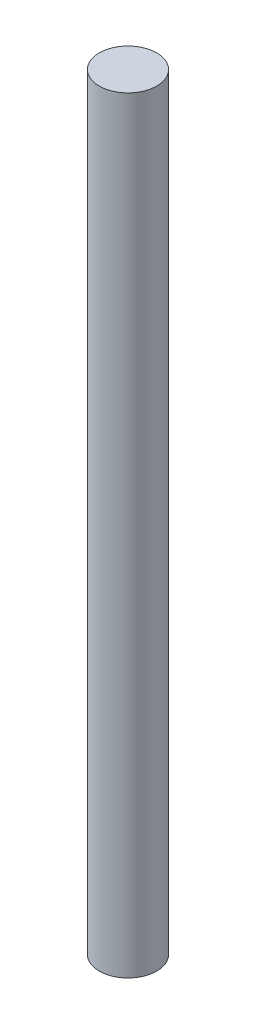
ISO-10303-21;
HEADER;
FILE_DESCRIPTION(('STEP AP214'),'2;1');
FILE_NAME('part.step','',(''),(''),'','','');
FILE_SCHEMA(('AUTOMOTIVE_DESIGN { 1 0 10303 214 1 1 1 1 }'));
ENDSEC;
DATA;
#1=APPLICATION_CONTEXT('core data for automotive mechanical design processes');
#2=APPLICATION_PROTOCOL_DEFINITION('international standard','automotive_design',2000,#1);
#3=PRODUCT_CONTEXT('',#1,'mechanical');
#4=PRODUCT('Part','Part','',(#3));
#5=PRODUCT_RELATED_PRODUCT_CATEGORY('part','',(#4));
#6=PRODUCT_DEFINITION_FORMATION('','',#4);
#7=PRODUCT_DEFINITION_CONTEXT('part definition',#1,'design');
#8=PRODUCT_DEFINITION('design','',#6,#7);
#9=PRODUCT_DEFINITION_SHAPE('','',#8);
#10=(LENGTH_UNIT() NAMED_UNIT(*) SI_UNIT(.MILLI.,.METRE.));
#11=(NAMED_UNIT(*) PLANE_ANGLE_UNIT() SI_UNIT($,.RADIAN.));
#12=(NAMED_UNIT(*) SI_UNIT($,.STERADIAN.) SOLID_ANGLE_UNIT());
#13=UNCERTAINTY_MEASURE_WITH_UNIT(LENGTH_MEASURE(1.E-05),#10,'distance_accuracy_value','');
#14=(GEOMETRIC_REPRESENTATION_CONTEXT(3) GLOBAL_UNCERTAINTY_ASSIGNED_CONTEXT((#13)) GLOBAL_UNIT_ASSIGNED_CONTEXT((#10,
#11,#12)) REPRESENTATION_CONTEXT('',''));
#15=CARTESIAN_POINT('',(0.,0.,0.));
#16=DIRECTION('',(0.,0.,1.));
#17=DIRECTION('',(1.,0.,0.));
#18=AXIS2_PLACEMENT_3D('',#15,#16,#17);
#19=CARTESIAN_POINT('',(0.,40.,0.));
#20=DIRECTION('',(0.,-1.,0.));
#21=DIRECTION('',(0.,0.,-1.));
#22=AXIS2_PLACEMENT_3D('',#19,#20,#21);
#23=CYLINDRICAL_SURFACE('',#22,1.5);
#24=CARTESIAN_POINT('',(0.,40.,0.));
#25=DIRECTION('',(0.,1.,0.));
#26=DIRECTION('',(0.,0.,1.));
#27=AXIS2_PLACEMENT_3D('',#24,#25,#26);
#28=CIRCLE('',#27,1.5);
#29=CARTESIAN_POINT('',(0.,40.,1.5));
#30=VERTEX_POINT('',#29);
#31=EDGE_CURVE('E10',#30,#30,#28,.T.);
#32=ORIENTED_EDGE('',*,*,#31,.F.);
#33=EDGE_LOOP('',(#32));
#34=FACE_BOUND('',#33,.T.);
#35=CARTESIAN_POINT('',(0.,0.,0.));
#36=DIRECTION('',(0.,1.,0.));
#37=DIRECTION('',(0.,0.,1.));
#38=AXIS2_PLACEMENT_3D('',#35,#36,#37);
#39=CIRCLE('',#38,1.5);
#40=CARTESIAN_POINT('',(0.,0.,1.5));
#41=VERTEX_POINT('',#40);
#42=EDGE_CURVE('E48',#41,#41,#39,.T.);
#43=ORIENTED_EDGE('',*,*,#42,.T.);
#44=EDGE_LOOP('',(#43));
#45=FACE_BOUND('',#44,.T.);
#46=ADVANCED_FACE('F45',(#34,#45),#23,.T.);
#47=CARTESIAN_POINT('',(0.,40.,0.));
#48=DIRECTION('',(0.,1.,0.));
#49=DIRECTION('',(0.,0.,1.));
#50=AXIS2_PLACEMENT_3D('',#47,#48,#49);
#51=PLANE('',#50);
#52=ORIENTED_EDGE('',*,*,#31,.T.);
#53=EDGE_LOOP('',(#52));
#54=FACE_BOUND('',#53,.T.);
#55=ADVANCED_FACE('F62',(#54),#51,.T.);
#56=CARTESIAN_POINT('',(0.,0.,0.));
#57=DIRECTION('',(0.,1.,0.));
#58=DIRECTION('',(0.,0.,1.));
#59=AXIS2_PLACEMENT_3D('',#56,#57,#58);
#60=PLANE('',#59);
#61=ORIENTED_EDGE('',*,*,#42,.F.);
#62=EDGE_LOOP('',(#61));
#63=FACE_BOUND('',#62,.T.);
#64=ADVANCED_FACE('F60',(#63),#60,.F.);
#65=CLOSED_SHELL('',(#46,#55,#64));
#66=MANIFOLD_SOLID_BREP('B2',#65);
#67=ADVANCED_BREP_SHAPE_REPRESENTATION('',(#18,#66),#14);
#68=SHAPE_DEFINITION_REPRESENTATION(#9,#67);
ENDSEC;
END-ISO-10303-21;
